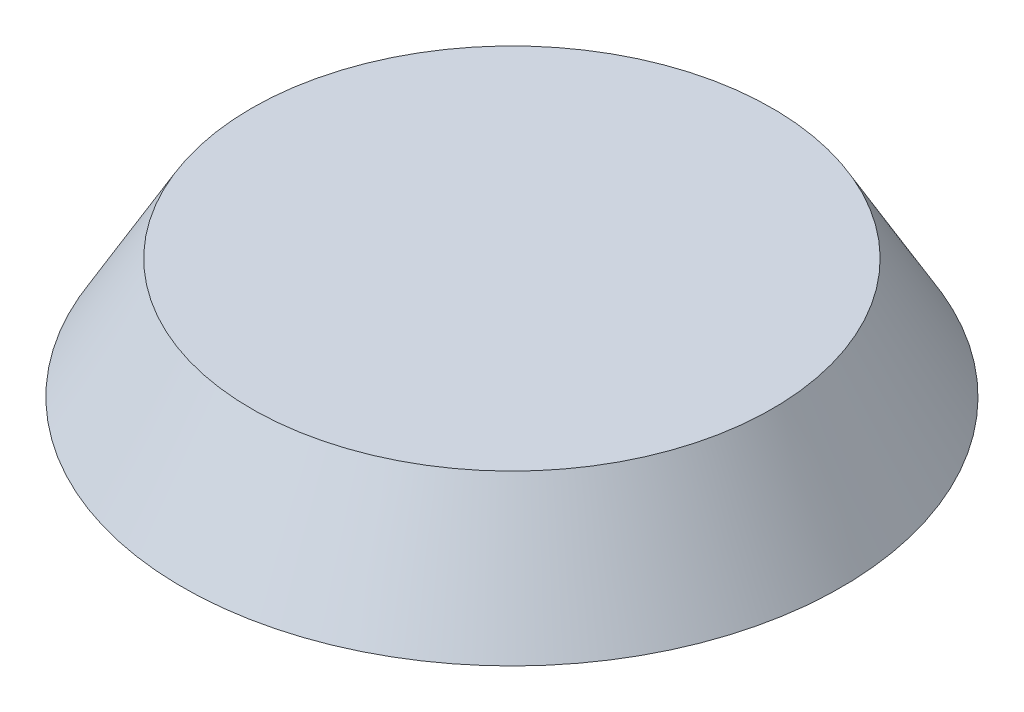
ISO-10303-21;
HEADER;
FILE_DESCRIPTION(('STEP AP214'),'2;1');
FILE_NAME('part.step','',(''),(''),'','','');
FILE_SCHEMA(('AUTOMOTIVE_DESIGN { 1 0 10303 214 1 1 1 1 }'));
ENDSEC;
DATA;
#1=APPLICATION_CONTEXT('core data for automotive mechanical design processes');
#2=APPLICATION_PROTOCOL_DEFINITION('international standard','automotive_design',2000,#1);
#3=PRODUCT_CONTEXT('',#1,'mechanical');
#4=PRODUCT('Part','Part','',(#3));
#5=PRODUCT_RELATED_PRODUCT_CATEGORY('part','',(#4));
#6=PRODUCT_DEFINITION_FORMATION('','',#4);
#7=PRODUCT_DEFINITION_CONTEXT('part definition',#1,'design');
#8=PRODUCT_DEFINITION('design','',#6,#7);
#9=PRODUCT_DEFINITION_SHAPE('','',#8);
#10=(LENGTH_UNIT() NAMED_UNIT(*) SI_UNIT(.MILLI.,.METRE.));
#11=(NAMED_UNIT(*) PLANE_ANGLE_UNIT() SI_UNIT($,.RADIAN.));
#12=(NAMED_UNIT(*) SI_UNIT($,.STERADIAN.) SOLID_ANGLE_UNIT());
#13=UNCERTAINTY_MEASURE_WITH_UNIT(LENGTH_MEASURE(1.E-05),#10,'distance_accuracy_value','');
#14=(GEOMETRIC_REPRESENTATION_CONTEXT(3) GLOBAL_UNCERTAINTY_ASSIGNED_CONTEXT((#13)) GLOBAL_UNIT_ASSIGNED_CONTEXT((#10,
#11,#12)) REPRESENTATION_CONTEXT('',''));
#15=CARTESIAN_POINT('',(0.,0.,0.));
#16=DIRECTION('',(0.,0.,1.));
#17=DIRECTION('',(1.,0.,0.));
#18=AXIS2_PLACEMENT_3D('',#15,#16,#17);
#19=CARTESIAN_POINT('',(0.,0.,-18.6));
#20=DIRECTION('',(0.,-1.,0.));
#21=DIRECTION('',(0.,0.,1.));
#22=AXIS2_PLACEMENT_3D('',#19,#20,#21);
#23=CONICAL_SURFACE('',#22,4.2,0.0174532925199433);
#24=CARTESIAN_POINT('',(0.,0.,-18.6));
#25=DIRECTION('',(0.,-1.,0.));
#26=DIRECTION('',(0.,0.,1.));
#27=AXIS2_PLACEMENT_3D('',#24,#25,#26);
#28=CIRCLE('',#27,4.2);
#29=CARTESIAN_POINT('',(4.2,0.,-18.6));
#30=VERTEX_POINT('',#29);
#31=CARTESIAN_POINT('',(-4.2,0.,-18.6));
#32=VERTEX_POINT('',#31);
#33=EDGE_CURVE('E176',#30,#32,#28,.T.);
#34=ORIENTED_EDGE('',*,*,#33,.F.);
#35=DIRECTION('',(-0.0174524064372835,0.999847695156391,0.));
#36=VECTOR('',#35,1.);
#37=CARTESIAN_POINT('',(4.2,0.,-18.6));
#38=LINE('',#37,#36);
#39=CARTESIAN_POINT('',(4.28727532464109,-5.,-18.6));
#40=VERTEX_POINT('',#39);
#41=EDGE_CURVE('E11',#40,#30,#38,.T.);
#42=ORIENTED_EDGE('',*,*,#41,.F.);
#43=CARTESIAN_POINT('',(0.,-5.,-18.6));
#44=DIRECTION('',(0.,1.,0.));
#45=DIRECTION('',(0.,0.,1.));
#46=AXIS2_PLACEMENT_3D('',#43,#44,#45);
#47=CIRCLE('',#46,4.28727532464109);
#48=CARTESIAN_POINT('',(-4.28727532464109,-5.,-18.6));
#49=VERTEX_POINT('',#48);
#50=EDGE_CURVE('E195',#40,#49,#47,.F.);
#51=ORIENTED_EDGE('',*,*,#50,.T.);
#52=DIRECTION('',(0.0174524064372835,0.999847695156391,0.));
#53=VECTOR('',#52,1.);
#54=CARTESIAN_POINT('',(-4.2,0.,-18.6));
#55=LINE('',#54,#53);
#56=EDGE_CURVE('E123',#49,#32,#55,.T.);
#57=ORIENTED_EDGE('',*,*,#56,.T.);
#58=EDGE_LOOP('',(#34,#42,#51,#57));
#59=FACE_BOUND('',#58,.T.);
#60=ADVANCED_FACE('F49',(#59),#23,.F.);
#61=CARTESIAN_POINT('',(4.2,0.,-18.6));
#62=DIRECTION('',(-0.999847695156391,-0.0174524064372835,0.));
#63=DIRECTION('',(0.0174524064372835,-0.999847695156391,0.));
#64=AXIS2_PLACEMENT_3D('',#61,#62,#63);
#65=PLANE('',#64);
#66=DIRECTION('',(0.,0.,1.));
#67=VECTOR('',#66,1.);
#68=CARTESIAN_POINT('',(4.2,0.,-18.6));
#69=LINE('',#68,#67);
#70=CARTESIAN_POINT('',(4.2,0.,-22.6132704401641));
#71=VERTEX_POINT('',#70);
#72=EDGE_CURVE('E187',#71,#30,#69,.T.);
#73=ORIENTED_EDGE('',*,*,#72,.F.);
#74=CARTESIAN_POINT('',(4.28727532464109,-5.,-22.508047946002));
#75=CARTESIAN_POINT('',(4.27272945221222,-4.1666675266641,-22.5256259065232));
#76=CARTESIAN_POINT('',(4.25818357227769,-3.333334623329,-22.5431834279639));
#77=CARTESIAN_POINT('',(4.22909179739732,-1.66666795666234,-22.5782575926847));
#78=CARTESIAN_POINT('',(4.2145459024515,-0.833334193330764,-22.5957742359646));
#79=CARTESIAN_POINT('',(4.2,0.,-22.6132704401641));
#80=B_SPLINE_CURVE_WITH_KNOTS('',3,(#74,#75,#76,#77,#78,#79),.UNSPECIFIED.,.F.,.F.,(4,2,4),(0.,
2.50093426396377,5.00186852792182),.UNSPECIFIED.);
#81=CARTESIAN_POINT('',(4.28727532464109,-5.,-22.508047946002));
#82=VERTEX_POINT('',#81);
#83=EDGE_CURVE('E60',#82,#71,#80,.T.);
#84=ORIENTED_EDGE('',*,*,#83,.F.);
#85=DIRECTION('',(0.,0.,1.));
#86=VECTOR('',#85,1.);
#87=CARTESIAN_POINT('',(4.28727532464109,-5.,-18.6));
#88=LINE('',#87,#86);
#89=EDGE_CURVE('E190',#82,#40,#88,.T.);
#90=ORIENTED_EDGE('',*,*,#89,.T.);
#91=ORIENTED_EDGE('',*,*,#41,.T.);
#92=EDGE_LOOP('',(#73,#84,#90,#91));
#93=FACE_BOUND('',#92,.T.);
#94=ADVANCED_FACE('F186',(#93),#65,.T.);
#95=CARTESIAN_POINT('',(0.,0.,0.));
#96=DIRECTION('',(0.,1.,0.));
#97=DIRECTION('',(0.,0.,1.));
#98=AXIS2_PLACEMENT_3D('',#95,#96,#97);
#99=CONICAL_SURFACE('',#98,23.,0.0174532925199433);
#100=CARTESIAN_POINT('',(0.,0.,0.));
#101=DIRECTION('',(0.,1.,0.));
#102=DIRECTION('',(0.,0.,1.));
#103=AXIS2_PLACEMENT_3D('',#100,#101,#102);
#104=CIRCLE('',#103,23.);
#105=CARTESIAN_POINT('',(22.6132704401641,0.,-4.19999999999994));
#106=VERTEX_POINT('',#105);
#107=EDGE_CURVE('E193',#106,#71,#104,.T.);
#108=ORIENTED_EDGE('',*,*,#107,.F.);
#109=CARTESIAN_POINT('',(22.508047946002,-5.,-4.28727532464102));
#110=CARTESIAN_POINT('',(22.5256259065232,-4.1666675266641,-4.27272945221215));
#111=CARTESIAN_POINT('',(22.543183427964,-3.333334623329,-4.25818357227762));
#112=CARTESIAN_POINT('',(22.5782575926847,-1.66666795666234,-4.22909179739726));
#113=CARTESIAN_POINT('',(22.5957742359646,-0.833334193330765,-4.21454590245143));
#114=CARTESIAN_POINT('',(22.6132704401641,0.,-4.19999999999994));
#115=B_SPLINE_CURVE_WITH_KNOTS('',3,(#109,#110,#111,#112,#113,#114),.UNSPECIFIED.,.F.,.F.,(4,2,
4),(0.,2.50093426396377,5.00186852792182),.UNSPECIFIED.);
#116=CARTESIAN_POINT('',(22.508047946002,-5.,-4.28727532464102));
#117=VERTEX_POINT('',#116);
#118=EDGE_CURVE('E136',#117,#106,#115,.T.);
#119=ORIENTED_EDGE('',*,*,#118,.F.);
#120=CARTESIAN_POINT('',(0.,-5.,0.));
#121=DIRECTION('',(0.,1.,0.));
#122=DIRECTION('',(0.,0.,1.));
#123=AXIS2_PLACEMENT_3D('',#120,#121,#122);
#124=CIRCLE('',#123,22.9127246753589);
#125=EDGE_CURVE('E386',#117,#82,#124,.T.);
#126=ORIENTED_EDGE('',*,*,#125,.T.);
#127=ORIENTED_EDGE('',*,*,#83,.T.);
#128=EDGE_LOOP('',(#108,#119,#126,#127));
#129=FACE_BOUND('',#128,.T.);
#130=ADVANCED_FACE('F305',(#129),#99,.T.);
#131=CARTESIAN_POINT('',(18.6,0.,-4.19999999999994));
#132=DIRECTION('',(0.,-0.0174524064372835,0.999847695156391));
#133=DIRECTION('',(0.,-0.999847695156391,-0.0174524064372835));
#134=AXIS2_PLACEMENT_3D('',#131,#132,#133);
#135=PLANE('',#134);
#136=DIRECTION('',(1.,0.,0.));
#137=VECTOR('',#136,1.);
#138=CARTESIAN_POINT('',(18.6,0.,-4.19999999999994));
#139=LINE('',#138,#137);
#140=CARTESIAN_POINT('',(18.6,0.,-4.19999999999994));
#141=VERTEX_POINT('',#140);
#142=EDGE_CURVE('E203',#141,#106,#139,.T.);
#143=ORIENTED_EDGE('',*,*,#142,.F.);
#144=DIRECTION('',(0.,0.999847695156391,0.0174524064372835));
#145=VECTOR('',#144,1.);
#146=CARTESIAN_POINT('',(18.6,0.,-4.19999999999993));
#147=LINE('',#146,#145);
#148=CARTESIAN_POINT('',(18.6,-5.,-4.28727532464102));
#149=VERTEX_POINT('',#148);
#150=EDGE_CURVE('E315',#149,#141,#147,.T.);
#151=ORIENTED_EDGE('',*,*,#150,.F.);
#152=DIRECTION('',(1.,0.,0.));
#153=VECTOR('',#152,1.);
#154=CARTESIAN_POINT('',(0.,-5.,-4.28727532464102));
#155=LINE('',#154,#153);
#156=EDGE_CURVE('E375',#149,#117,#155,.T.);
#157=ORIENTED_EDGE('',*,*,#156,.T.);
#158=ORIENTED_EDGE('',*,*,#118,.T.);
#159=EDGE_LOOP('',(#143,#151,#157,#158));
#160=FACE_BOUND('',#159,.T.);
#161=ADVANCED_FACE('F301',(#160),#135,.T.);
#162=CARTESIAN_POINT('',(18.6,0.,0.));
#163=DIRECTION('',(0.,-1.,0.));
#164=DIRECTION('',(0.,0.,-1.));
#165=AXIS2_PLACEMENT_3D('',#162,#163,#164);
#166=CONICAL_SURFACE('',#165,4.2,0.0174532925199433);
#167=CARTESIAN_POINT('',(18.6,0.,0.));
#168=DIRECTION('',(0.,-1.,0.));
#169=DIRECTION('',(0.,0.,-1.));
#170=AXIS2_PLACEMENT_3D('',#167,#168,#169);
#171=CIRCLE('',#170,4.2);
#172=CARTESIAN_POINT('',(18.6,0.,4.20000000000006));
#173=VERTEX_POINT('',#172);
#174=EDGE_CURVE('E367',#173,#141,#171,.T.);
#175=ORIENTED_EDGE('',*,*,#174,.F.);
#176=DIRECTION('',(0.,0.999847695156391,-0.0174524064372835));
#177=VECTOR('',#176,1.);
#178=CARTESIAN_POINT('',(18.6,0.,4.20000000000006));
#179=LINE('',#178,#177);
#180=CARTESIAN_POINT('',(18.6,-5.,4.28727532464115));
#181=VERTEX_POINT('',#180);
#182=EDGE_CURVE('E294',#181,#173,#179,.T.);
#183=ORIENTED_EDGE('',*,*,#182,.F.);
#184=CARTESIAN_POINT('',(18.6,-5.,0.));
#185=DIRECTION('',(0.,1.,0.));
#186=DIRECTION('',(0.,0.,1.));
#187=AXIS2_PLACEMENT_3D('',#184,#185,#186);
#188=CIRCLE('',#187,4.28727532464109);
#189=EDGE_CURVE('E384',#181,#149,#188,.F.);
#190=ORIENTED_EDGE('',*,*,#189,.T.);
#191=ORIENTED_EDGE('',*,*,#150,.T.);
#192=EDGE_LOOP('',(#175,#183,#190,#191));
#193=FACE_BOUND('',#192,.T.);
#194=ADVANCED_FACE('F51',(#193),#166,.F.);
#195=CARTESIAN_POINT('',(18.6,0.,4.20000000000006));
#196=DIRECTION('',(0.,-0.0174524064372835,-0.999847695156391));
#197=DIRECTION('',(0.,0.999847695156391,-0.0174524064372835));
#198=AXIS2_PLACEMENT_3D('',#195,#196,#197);
#199=PLANE('',#198);
#200=DIRECTION('',(-1.,0.,0.));
#201=VECTOR('',#200,1.);
#202=CARTESIAN_POINT('',(18.6,0.,4.20000000000006));
#203=LINE('',#202,#201);
#204=CARTESIAN_POINT('',(22.6132704401641,0.,4.20000000000006));
#205=VERTEX_POINT('',#204);
#206=EDGE_CURVE('E363',#205,#173,#203,.T.);
#207=ORIENTED_EDGE('',*,*,#206,.F.);
#208=CARTESIAN_POINT('',(22.508047946002,-5.,4.28727532464115));
#209=CARTESIAN_POINT('',(22.5256259065232,-4.1666675266641,4.27272945221228));
#210=CARTESIAN_POINT('',(22.5431834279639,-3.333334623329,4.25818357227775));
#211=CARTESIAN_POINT('',(22.5782575926846,-1.66666795666234,4.22909179739738));
#212=CARTESIAN_POINT('',(22.5957742359646,-0.833334193330764,4.21454590245156));
#213=CARTESIAN_POINT('',(22.6132704401641,0.,4.20000000000006));
#214=B_SPLINE_CURVE_WITH_KNOTS('',3,(#208,#209,#210,#211,#212,#213),.UNSPECIFIED.,.F.,.F.,(4,2,
4),(0.,2.50093426396377,5.00186852792182),.UNSPECIFIED.);
#215=CARTESIAN_POINT('',(22.508047946002,-5.,4.28727532464115));
#216=VERTEX_POINT('',#215);
#217=EDGE_CURVE('E286',#216,#205,#214,.T.);
#218=ORIENTED_EDGE('',*,*,#217,.F.);
#219=DIRECTION('',(-1.,0.,0.));
#220=VECTOR('',#219,1.);
#221=CARTESIAN_POINT('',(0.,-5.,4.28727532464115));
#222=LINE('',#221,#220);
#223=EDGE_CURVE('E390',#216,#181,#222,.T.);
#224=ORIENTED_EDGE('',*,*,#223,.T.);
#225=ORIENTED_EDGE('',*,*,#182,.T.);
#226=EDGE_LOOP('',(#207,#218,#224,#225));
#227=FACE_BOUND('',#226,.T.);
#228=ADVANCED_FACE('F296',(#227),#199,.T.);
#229=CARTESIAN_POINT('',(0.,0.,0.));
#230=DIRECTION('',(0.,1.,0.));
#231=DIRECTION('',(0.,0.,1.));
#232=AXIS2_PLACEMENT_3D('',#229,#230,#231);
#233=CONICAL_SURFACE('',#232,23.,0.0174532925199433);
#234=CARTESIAN_POINT('',(0.,0.,0.));
#235=DIRECTION('',(0.,1.,0.));
#236=DIRECTION('',(0.,0.,1.));
#237=AXIS2_PLACEMENT_3D('',#234,#235,#236);
#238=CIRCLE('',#237,23.);
#239=CARTESIAN_POINT('',(4.2,0.,22.6132704401641));
#240=VERTEX_POINT('',#239);
#241=EDGE_CURVE('E360',#240,#205,#238,.T.);
#242=ORIENTED_EDGE('',*,*,#241,.F.);
#243=CARTESIAN_POINT('',(4.28727532464109,-5.,22.508047946002));
#244=CARTESIAN_POINT('',(4.27272945221222,-4.1666675266641,22.5256259065232));
#245=CARTESIAN_POINT('',(4.25818357227769,-3.333334623329,22.5431834279639));
#246=CARTESIAN_POINT('',(4.22909179739732,-1.66666795666234,22.5782575926847));
#247=CARTESIAN_POINT('',(4.2145459024515,-0.833334193330764,22.5957742359646));
#248=CARTESIAN_POINT('',(4.2,0.,22.6132704401641));
#249=B_SPLINE_CURVE_WITH_KNOTS('',3,(#243,#244,#245,#246,#247,#248),.UNSPECIFIED.,.F.,.F.,(4,2,
4),(0.,2.50093426396377,5.00186852792182),.UNSPECIFIED.);
#250=CARTESIAN_POINT('',(4.28727532464109,-5.,22.508047946002));
#251=VERTEX_POINT('',#250);
#252=EDGE_CURVE('E279',#251,#240,#249,.T.);
#253=ORIENTED_EDGE('',*,*,#252,.F.);
#254=CARTESIAN_POINT('',(0.,-5.,0.));
#255=DIRECTION('',(0.,1.,0.));
#256=DIRECTION('',(0.,0.,1.));
#257=AXIS2_PLACEMENT_3D('',#254,#255,#256);
#258=CIRCLE('',#257,22.9127246753589);
#259=EDGE_CURVE('E395',#251,#216,#258,.T.);
#260=ORIENTED_EDGE('',*,*,#259,.T.);
#261=ORIENTED_EDGE('',*,*,#217,.T.);
#262=EDGE_LOOP('',(#242,#253,#260,#261));
#263=FACE_BOUND('',#262,.T.);
#264=ADVANCED_FACE('F274',(#263),#233,.T.);
#265=CARTESIAN_POINT('',(4.2,0.,18.6));
#266=DIRECTION('',(-0.999847695156391,-0.0174524064372835,0.));
#267=DIRECTION('',(0.0174524064372835,-0.999847695156391,0.));
#268=AXIS2_PLACEMENT_3D('',#265,#266,#267);
#269=PLANE('',#268);
#270=DIRECTION('',(0.,0.,1.));
#271=VECTOR('',#270,1.);
#272=CARTESIAN_POINT('',(4.2,0.,18.6));
#273=LINE('',#272,#271);
#274=CARTESIAN_POINT('',(4.2,0.,18.6));
#275=VERTEX_POINT('',#274);
#276=EDGE_CURVE('E341',#275,#240,#273,.T.);
#277=ORIENTED_EDGE('',*,*,#276,.F.);
#278=DIRECTION('',(-0.0174524064372835,0.999847695156391,0.));
#279=VECTOR('',#278,1.);
#280=CARTESIAN_POINT('',(4.2,0.,18.6));
#281=LINE('',#280,#279);
#282=CARTESIAN_POINT('',(4.28727532464109,-5.,18.6));
#283=VERTEX_POINT('',#282);
#284=EDGE_CURVE('E287',#283,#275,#281,.T.);
#285=ORIENTED_EDGE('',*,*,#284,.F.);
#286=DIRECTION('',(0.,0.,1.));
#287=VECTOR('',#286,1.);
#288=CARTESIAN_POINT('',(4.28727532464109,-5.,-18.6));
#289=LINE('',#288,#287);
#290=EDGE_CURVE('E402',#283,#251,#289,.T.);
#291=ORIENTED_EDGE('',*,*,#290,.T.);
#292=ORIENTED_EDGE('',*,*,#252,.T.);
#293=EDGE_LOOP('',(#277,#285,#291,#292));
#294=FACE_BOUND('',#293,.T.);
#295=ADVANCED_FACE('F270',(#294),#269,.T.);
#296=CARTESIAN_POINT('',(0.,0.,18.6));
#297=DIRECTION('',(0.,-1.,0.));
#298=DIRECTION('',(0.,0.,-1.));
#299=AXIS2_PLACEMENT_3D('',#296,#297,#298);
#300=CONICAL_SURFACE('',#299,4.2,0.0174532925199433);
#301=CARTESIAN_POINT('',(0.,0.,18.6));
#302=DIRECTION('',(0.,-1.,0.));
#303=DIRECTION('',(0.,0.,-1.));
#304=AXIS2_PLACEMENT_3D('',#301,#302,#303);
#305=CIRCLE('',#304,4.2);
#306=CARTESIAN_POINT('',(-4.2,0.,18.6));
#307=VERTEX_POINT('',#306);
#308=EDGE_CURVE('E334',#307,#275,#305,.T.);
#309=ORIENTED_EDGE('',*,*,#308,.F.);
#310=DIRECTION('',(0.0174524064372835,0.999847695156391,0.));
#311=VECTOR('',#310,1.);
#312=CARTESIAN_POINT('',(-4.2,0.,18.6));
#313=LINE('',#312,#311);
#314=CARTESIAN_POINT('',(-4.28727532464108,-5.,18.6));
#315=VERTEX_POINT('',#314);
#316=EDGE_CURVE('E262',#315,#307,#313,.T.);
#317=ORIENTED_EDGE('',*,*,#316,.F.);
#318=CARTESIAN_POINT('',(0.,-5.,18.6));
#319=DIRECTION('',(0.,1.,0.));
#320=DIRECTION('',(0.,0.,1.));
#321=AXIS2_PLACEMENT_3D('',#318,#319,#320);
#322=CIRCLE('',#321,4.28727532464109);
#323=EDGE_CURVE('E406',#315,#283,#322,.F.);
#324=ORIENTED_EDGE('',*,*,#323,.T.);
#325=ORIENTED_EDGE('',*,*,#284,.T.);
#326=EDGE_LOOP('',(#309,#317,#324,#325));
#327=FACE_BOUND('',#326,.T.);
#328=ADVANCED_FACE('F268',(#327),#300,.F.);
#329=CARTESIAN_POINT('',(-4.2,0.,18.6));
#330=DIRECTION('',(0.999847695156391,-0.0174524064372835,0.));
#331=DIRECTION('',(0.0174524064372835,0.999847695156391,0.));
#332=AXIS2_PLACEMENT_3D('',#329,#330,#331);
#333=PLANE('',#332);
#334=DIRECTION('',(0.,0.,-1.));
#335=VECTOR('',#334,1.);
#336=CARTESIAN_POINT('',(-4.2,0.,18.6));
#337=LINE('',#336,#335);
#338=CARTESIAN_POINT('',(-4.2,0.,22.6132704401641));
#339=VERTEX_POINT('',#338);
#340=EDGE_CURVE('E342',#339,#307,#337,.T.);
#341=ORIENTED_EDGE('',*,*,#340,.F.);
#342=CARTESIAN_POINT('',(-4.28727532464108,-5.,22.508047946002));
#343=CARTESIAN_POINT('',(-4.27272945221222,-4.1666675266641,22.5256259065232));
#344=CARTESIAN_POINT('',(-4.25818357227768,-3.333334623329,22.5431834279639));
#345=CARTESIAN_POINT('',(-4.22909179739732,-1.66666795666234,22.5782575926847));
#346=CARTESIAN_POINT('',(-4.21454590245149,-0.833334193330764,22.5957742359646));
#347=CARTESIAN_POINT('',(-4.2,0.,22.6132704401641));
#348=B_SPLINE_CURVE_WITH_KNOTS('',3,(#342,#343,#344,#345,#346,#347),.UNSPECIFIED.,.F.,.F.,(4,2,
4),(0.,2.50093426396377,5.00186852792182),.UNSPECIFIED.);
#349=CARTESIAN_POINT('',(-4.28727532464108,-5.,22.508047946002));
#350=VERTEX_POINT('',#349);
#351=EDGE_CURVE('E254',#350,#339,#348,.T.);
#352=ORIENTED_EDGE('',*,*,#351,.F.);
#353=DIRECTION('',(0.,0.,-1.));
#354=VECTOR('',#353,1.);
#355=CARTESIAN_POINT('',(-4.28727532464108,-5.,-18.6));
#356=LINE('',#355,#354);
#357=EDGE_CURVE('E409',#350,#315,#356,.T.);
#358=ORIENTED_EDGE('',*,*,#357,.T.);
#359=ORIENTED_EDGE('',*,*,#316,.T.);
#360=EDGE_LOOP('',(#341,#352,#358,#359));
#361=FACE_BOUND('',#360,.T.);
#362=ADVANCED_FACE('F264',(#361),#333,.T.);
#363=CARTESIAN_POINT('',(0.,0.,0.));
#364=DIRECTION('',(0.,1.,0.));
#365=DIRECTION('',(0.,0.,1.));
#366=AXIS2_PLACEMENT_3D('',#363,#364,#365);
#367=CONICAL_SURFACE('',#366,23.,0.0174532925199433);
#368=CARTESIAN_POINT('',(0.,0.,0.));
#369=DIRECTION('',(0.,1.,0.));
#370=DIRECTION('',(0.,0.,1.));
#371=AXIS2_PLACEMENT_3D('',#368,#369,#370);
#372=CIRCLE('',#371,23.);
#373=CARTESIAN_POINT('',(-22.6132704401641,0.,4.20000000000005));
#374=VERTEX_POINT('',#373);
#375=EDGE_CURVE('E348',#374,#339,#372,.T.);
#376=ORIENTED_EDGE('',*,*,#375,.F.);
#377=CARTESIAN_POINT('',(-22.508047946002,-5.,4.28727532464115));
#378=CARTESIAN_POINT('',(-22.5256259065232,-4.1666675266641,4.27272945221228));
#379=CARTESIAN_POINT('',(-22.5431834279639,-3.333334623329,4.25818357227775));
#380=CARTESIAN_POINT('',(-22.5782575926846,-1.66666795666234,4.22909179739738));
#381=CARTESIAN_POINT('',(-22.5957742359646,-0.833334193330764,4.21454590245156));
#382=CARTESIAN_POINT('',(-22.6132704401641,0.,4.20000000000006));
#383=B_SPLINE_CURVE_WITH_KNOTS('',3,(#377,#378,#379,#380,#381,#382),.UNSPECIFIED.,.F.,.F.,(4,2,
4),(0.,2.50093426396377,5.00186852792182),.UNSPECIFIED.);
#384=CARTESIAN_POINT('',(-22.508047946002,-5.,4.28727532464115));
#385=VERTEX_POINT('',#384);
#386=EDGE_CURVE('E246',#385,#374,#383,.T.);
#387=ORIENTED_EDGE('',*,*,#386,.F.);
#388=CARTESIAN_POINT('',(0.,-5.,0.));
#389=DIRECTION('',(0.,1.,0.));
#390=DIRECTION('',(0.,0.,1.));
#391=AXIS2_PLACEMENT_3D('',#388,#389,#390);
#392=CIRCLE('',#391,22.9127246753589);
#393=EDGE_CURVE('E413',#385,#350,#392,.T.);
#394=ORIENTED_EDGE('',*,*,#393,.T.);
#395=ORIENTED_EDGE('',*,*,#351,.T.);
#396=EDGE_LOOP('',(#376,#387,#394,#395));
#397=FACE_BOUND('',#396,.T.);
#398=ADVANCED_FACE('F241',(#397),#367,.T.);
#399=CARTESIAN_POINT('',(-18.6,0.,4.20000000000006));
#400=DIRECTION('',(0.,-0.0174524064372835,-0.999847695156391));
#401=DIRECTION('',(0.,0.999847695156391,-0.0174524064372835));
#402=AXIS2_PLACEMENT_3D('',#399,#400,#401);
#403=PLANE('',#402);
#404=DIRECTION('',(-1.,0.,0.));
#405=VECTOR('',#404,1.);
#406=CARTESIAN_POINT('',(-18.6,0.,4.20000000000006));
#407=LINE('',#406,#405);
#408=CARTESIAN_POINT('',(-18.6,0.,4.20000000000006));
#409=VERTEX_POINT('',#408);
#410=EDGE_CURVE('E354',#409,#374,#407,.T.);
#411=ORIENTED_EDGE('',*,*,#410,.F.);
#412=DIRECTION('',(0.,0.999847695156391,-0.0174524064372835));
#413=VECTOR('',#412,1.);
#414=CARTESIAN_POINT('',(-18.6,0.,4.20000000000006));
#415=LINE('',#414,#413);
#416=CARTESIAN_POINT('',(-18.6,-5.,4.28727532464115));
#417=VERTEX_POINT('',#416);
#418=EDGE_CURVE('E255',#417,#409,#415,.T.);
#419=ORIENTED_EDGE('',*,*,#418,.F.);
#420=DIRECTION('',(-1.,0.,0.));
#421=VECTOR('',#420,1.);
#422=CARTESIAN_POINT('',(0.,-5.,4.28727532464115));
#423=LINE('',#422,#421);
#424=EDGE_CURVE('E416',#417,#385,#423,.T.);
#425=ORIENTED_EDGE('',*,*,#424,.T.);
#426=ORIENTED_EDGE('',*,*,#386,.T.);
#427=EDGE_LOOP('',(#411,#419,#425,#426));
#428=FACE_BOUND('',#427,.T.);
#429=ADVANCED_FACE('F237',(#428),#403,.T.);
#430=CARTESIAN_POINT('',(-18.6,0.,0.));
#431=DIRECTION('',(0.,-1.,0.));
#432=DIRECTION('',(0.,0.,1.));
#433=AXIS2_PLACEMENT_3D('',#430,#431,#432);
#434=CONICAL_SURFACE('',#433,4.2,0.0174532925199433);
#435=CARTESIAN_POINT('',(-18.6,0.,0.));
#436=DIRECTION('',(0.,-1.,0.));
#437=DIRECTION('',(0.,0.,1.));
#438=AXIS2_PLACEMENT_3D('',#435,#436,#437);
#439=CIRCLE('',#438,4.2);
#440=CARTESIAN_POINT('',(-18.6,0.,-4.19999999999994));
#441=VERTEX_POINT('',#440);
#442=EDGE_CURVE('E452',#441,#409,#439,.T.);
#443=ORIENTED_EDGE('',*,*,#442,.F.);
#444=DIRECTION('',(0.,0.999847695156391,0.0174524064372835));
#445=VECTOR('',#444,1.);
#446=CARTESIAN_POINT('',(-18.6,0.,-4.19999999999994));
#447=LINE('',#446,#445);
#448=CARTESIAN_POINT('',(-18.6,-5.,-4.28727532464102));
#449=VERTEX_POINT('',#448);
#450=EDGE_CURVE('E436',#449,#441,#447,.T.);
#451=ORIENTED_EDGE('',*,*,#450,.F.);
#452=CARTESIAN_POINT('',(-18.6,-5.,0.));
#453=DIRECTION('',(0.,1.,0.));
#454=DIRECTION('',(0.,0.,1.));
#455=AXIS2_PLACEMENT_3D('',#452,#453,#454);
#456=CIRCLE('',#455,4.28727532464109);
#457=EDGE_CURVE('E419',#449,#417,#456,.F.);
#458=ORIENTED_EDGE('',*,*,#457,.T.);
#459=ORIENTED_EDGE('',*,*,#418,.T.);
#460=EDGE_LOOP('',(#443,#451,#458,#459));
#461=FACE_BOUND('',#460,.T.);
#462=ADVANCED_FACE('F235',(#461),#434,.F.);
#463=CARTESIAN_POINT('',(-18.6,0.,-4.19999999999994));
#464=DIRECTION('',(0.,-0.0174524064372835,0.999847695156391));
#465=DIRECTION('',(0.,-0.999847695156391,-0.0174524064372835));
#466=AXIS2_PLACEMENT_3D('',#463,#464,#465);
#467=PLANE('',#466);
#468=DIRECTION('',(1.,0.,0.));
#469=VECTOR('',#468,1.);
#470=CARTESIAN_POINT('',(-18.6,0.,-4.19999999999994));
#471=LINE('',#470,#469);
#472=CARTESIAN_POINT('',(-22.6132704401641,0.,-4.19999999999994));
#473=VERTEX_POINT('',#472);
#474=EDGE_CURVE('E439',#473,#441,#471,.T.);
#475=ORIENTED_EDGE('',*,*,#474,.F.);
#476=CARTESIAN_POINT('',(-22.508047946002,-5.,-4.28727532464102));
#477=CARTESIAN_POINT('',(-22.5256259065232,-4.1666675266641,-4.27272945221215));
#478=CARTESIAN_POINT('',(-22.543183427964,-3.333334623329,-4.25818357227762));
#479=CARTESIAN_POINT('',(-22.5782575926847,-1.66666795666234,-4.22909179739726));
#480=CARTESIAN_POINT('',(-22.5957742359646,-0.833334193330765,-4.21454590245143));
#481=CARTESIAN_POINT('',(-22.6132704401641,0.,-4.19999999999994));
#482=B_SPLINE_CURVE_WITH_KNOTS('',3,(#476,#477,#478,#479,#480,#481),.UNSPECIFIED.,.F.,.F.,(4,2,
4),(0.,2.50093426396377,5.00186852792182),.UNSPECIFIED.);
#483=CARTESIAN_POINT('',(-22.508047946002,-5.,-4.28727532464102));
#484=VERTEX_POINT('',#483);
#485=EDGE_CURVE('E217',#484,#473,#482,.T.);
#486=ORIENTED_EDGE('',*,*,#485,.F.);
#487=DIRECTION('',(1.,0.,0.));
#488=VECTOR('',#487,1.);
#489=CARTESIAN_POINT('',(0.,-5.,-4.28727532464102));
#490=LINE('',#489,#488);
#491=EDGE_CURVE('E423',#484,#449,#490,.T.);
#492=ORIENTED_EDGE('',*,*,#491,.T.);
#493=ORIENTED_EDGE('',*,*,#450,.T.);
#494=EDGE_LOOP('',(#475,#486,#492,#493));
#495=FACE_BOUND('',#494,.T.);
#496=ADVANCED_FACE('F230',(#495),#467,.T.);
#497=CARTESIAN_POINT('',(0.,0.,0.));
#498=DIRECTION('',(0.,1.,0.));
#499=DIRECTION('',(0.,0.,1.));
#500=AXIS2_PLACEMENT_3D('',#497,#498,#499);
#501=CONICAL_SURFACE('',#500,23.,0.0174532925199433);
#502=CARTESIAN_POINT('',(0.,0.,0.));
#503=DIRECTION('',(0.,1.,0.));
#504=DIRECTION('',(0.,0.,1.));
#505=AXIS2_PLACEMENT_3D('',#502,#503,#504);
#506=CIRCLE('',#505,23.);
#507=CARTESIAN_POINT('',(-4.2,0.,-22.6132704401641));
#508=VERTEX_POINT('',#507);
#509=EDGE_CURVE('E457',#508,#473,#506,.T.);
#510=ORIENTED_EDGE('',*,*,#509,.F.);
#511=CARTESIAN_POINT('',(-4.28727532464109,-5.,-22.508047946002));
#512=CARTESIAN_POINT('',(-4.27272945221222,-4.1666675266641,-22.5256259065232));
#513=CARTESIAN_POINT('',(-4.25818357227769,-3.333334623329,-22.5431834279639));
#514=CARTESIAN_POINT('',(-4.22909179739732,-1.66666795666234,-22.5782575926847));
#515=CARTESIAN_POINT('',(-4.2145459024515,-0.833334193330764,-22.5957742359646));
#516=CARTESIAN_POINT('',(-4.2,0.,-22.6132704401641));
#517=B_SPLINE_CURVE_WITH_KNOTS('',3,(#511,#512,#513,#514,#515,#516),.UNSPECIFIED.,.F.,.F.,(4,2,
4),(0.,2.50093426396377,5.00186852792182),.UNSPECIFIED.);
#518=CARTESIAN_POINT('',(-4.28727532464109,-5.,-22.508047946002));
#519=VERTEX_POINT('',#518);
#520=EDGE_CURVE('E116',#519,#508,#517,.T.);
#521=ORIENTED_EDGE('',*,*,#520,.F.);
#522=CARTESIAN_POINT('',(0.,-5.,0.));
#523=DIRECTION('',(0.,1.,0.));
#524=DIRECTION('',(0.,0.,1.));
#525=AXIS2_PLACEMENT_3D('',#522,#523,#524);
#526=CIRCLE('',#525,22.9127246753589);
#527=EDGE_CURVE('E426',#519,#484,#526,.T.);
#528=ORIENTED_EDGE('',*,*,#527,.T.);
#529=ORIENTED_EDGE('',*,*,#485,.T.);
#530=EDGE_LOOP('',(#510,#521,#528,#529));
#531=FACE_BOUND('',#530,.T.);
#532=ADVANCED_FACE('F227',(#531),#501,.T.);
#533=CARTESIAN_POINT('',(-4.2,0.,-18.6));
#534=DIRECTION('',(0.999847695156391,-0.0174524064372835,0.));
#535=DIRECTION('',(0.0174524064372835,0.999847695156391,0.));
#536=AXIS2_PLACEMENT_3D('',#533,#534,#535);
#537=PLANE('',#536);
#538=DIRECTION('',(0.,0.,-1.));
#539=VECTOR('',#538,1.);
#540=CARTESIAN_POINT('',(-4.2,0.,-18.6));
#541=LINE('',#540,#539);
#542=EDGE_CURVE('E181',#32,#508,#541,.T.);
#543=ORIENTED_EDGE('',*,*,#542,.F.);
#544=ORIENTED_EDGE('',*,*,#56,.F.);
#545=DIRECTION('',(0.,0.,-1.));
#546=VECTOR('',#545,1.);
#547=CARTESIAN_POINT('',(-4.28727532464109,-5.,-18.6));
#548=LINE('',#547,#546);
#549=EDGE_CURVE('E53',#49,#519,#548,.T.);
#550=ORIENTED_EDGE('',*,*,#549,.T.);
#551=ORIENTED_EDGE('',*,*,#520,.T.);
#552=EDGE_LOOP('',(#543,#544,#550,#551));
#553=FACE_BOUND('',#552,.T.);
#554=ADVANCED_FACE('F224',(#553),#537,.T.);
#555=CARTESIAN_POINT('',(0.,-5.,-18.6));
#556=DIRECTION('',(0.,1.,0.));
#557=DIRECTION('',(0.,0.,1.));
#558=AXIS2_PLACEMENT_3D('',#555,#556,#557);
#559=PLANE('',#558);
#560=ORIENTED_EDGE('',*,*,#50,.F.);
#561=ORIENTED_EDGE('',*,*,#89,.F.);
#562=ORIENTED_EDGE('',*,*,#125,.F.);
#563=ORIENTED_EDGE('',*,*,#156,.F.);
#564=ORIENTED_EDGE('',*,*,#189,.F.);
#565=ORIENTED_EDGE('',*,*,#223,.F.);
#566=ORIENTED_EDGE('',*,*,#259,.F.);
#567=ORIENTED_EDGE('',*,*,#290,.F.);
#568=ORIENTED_EDGE('',*,*,#323,.F.);
#569=ORIENTED_EDGE('',*,*,#357,.F.);
#570=ORIENTED_EDGE('',*,*,#393,.F.);
#571=ORIENTED_EDGE('',*,*,#424,.F.);
#572=ORIENTED_EDGE('',*,*,#457,.F.);
#573=ORIENTED_EDGE('',*,*,#491,.F.);
#574=ORIENTED_EDGE('',*,*,#527,.F.);
#575=ORIENTED_EDGE('',*,*,#549,.F.);
#576=EDGE_LOOP('',(#560,#561,#562,#563,#564,#565,#566,#567,#568,#569,#570,#571,#572,#573,#574,#575));
#577=FACE_BOUND('',#576,.T.);
#578=ADVANCED_FACE('F382',(#577),#559,.F.);
#579=CARTESIAN_POINT('',(0.,0.,0.));
#580=DIRECTION('',(0.,1.,0.));
#581=DIRECTION('',(-1.,0.,0.));
#582=AXIS2_PLACEMENT_3D('',#579,#580,#581);
#583=PLANE('',#582);
#584=CARTESIAN_POINT('',(0.,0.,0.));
#585=DIRECTION('',(0.,1.,0.));
#586=DIRECTION('',(-1.,0.,0.));
#587=AXIS2_PLACEMENT_3D('',#584,#585,#586);
#588=CIRCLE('',#587,55.);
#589=CARTESIAN_POINT('',(-55.,0.,0.));
#590=VERTEX_POINT('',#589);
#591=EDGE_CURVE('E182',#590,#590,#588,.T.);
#592=ORIENTED_EDGE('',*,*,#591,.F.);
#593=EDGE_LOOP('',(#592));
#594=FACE_BOUND('',#593,.T.);
#595=ORIENTED_EDGE('',*,*,#72,.T.);
#596=ORIENTED_EDGE('',*,*,#33,.T.);
#597=ORIENTED_EDGE('',*,*,#542,.T.);
#598=ORIENTED_EDGE('',*,*,#509,.T.);
#599=ORIENTED_EDGE('',*,*,#474,.T.);
#600=ORIENTED_EDGE('',*,*,#442,.T.);
#601=ORIENTED_EDGE('',*,*,#410,.T.);
#602=ORIENTED_EDGE('',*,*,#375,.T.);
#603=ORIENTED_EDGE('',*,*,#340,.T.);
#604=ORIENTED_EDGE('',*,*,#308,.T.);
#605=ORIENTED_EDGE('',*,*,#276,.T.);
#606=ORIENTED_EDGE('',*,*,#241,.T.);
#607=ORIENTED_EDGE('',*,*,#206,.T.);
#608=ORIENTED_EDGE('',*,*,#174,.T.);
#609=ORIENTED_EDGE('',*,*,#142,.T.);
#610=ORIENTED_EDGE('',*,*,#107,.T.);
#611=EDGE_LOOP('',(#595,#596,#597,#598,#599,#600,#601,#602,#603,#604,#605,#606,#607,#608,#609,#610));
#612=FACE_BOUND('',#611,.T.);
#613=ADVANCED_FACE('F191',(#594,#612),#583,.F.);
#614=CARTESIAN_POINT('',(0.,0.,0.));
#615=DIRECTION('',(0.,-1.,0.));
#616=DIRECTION('',(1.,0.,0.));
#617=AXIS2_PLACEMENT_3D('',#614,#615,#616);
#618=CONICAL_SURFACE('',#617,55.,0.523598775598304);
#619=CARTESIAN_POINT('',(0.,20.,0.));
#620=DIRECTION('',(0.,1.,0.));
#621=DIRECTION('',(-1.,0.,0.));
#622=AXIS2_PLACEMENT_3D('',#619,#620,#621);
#623=CIRCLE('',#622,43.4529946162073);
#624=CARTESIAN_POINT('',(-43.4529946162073,20.,0.));
#625=VERTEX_POINT('',#624);
#626=EDGE_CURVE('E467',#625,#625,#623,.T.);
#627=ORIENTED_EDGE('',*,*,#626,.F.);
#628=EDGE_LOOP('',(#627));
#629=FACE_BOUND('',#628,.T.);
#630=ORIENTED_EDGE('',*,*,#591,.T.);
#631=EDGE_LOOP('',(#630));
#632=FACE_BOUND('',#631,.T.);
#633=ADVANCED_FACE('F475',(#629,#632),#618,.T.);
#634=CARTESIAN_POINT('',(43.4529946162073,20.,0.));
#635=DIRECTION('',(0.,-1.,0.));
#636=DIRECTION('',(1.,0.,0.));
#637=AXIS2_PLACEMENT_3D('',#634,#635,#636);
#638=PLANE('',#637);
#639=ORIENTED_EDGE('',*,*,#626,.T.);
#640=EDGE_LOOP('',(#639));
#641=FACE_BOUND('',#640,.T.);
#642=ADVANCED_FACE('F473',(#641),#638,.F.);
#643=CLOSED_SHELL('',(#60,#94,#130,#161,#194,#228,#264,#295,#328,#362,#398,#429,#462,#496,#532,
#554,#578,#613,#633,#642));
#644=MANIFOLD_SOLID_BREP('B2',#643);
#645=ADVANCED_BREP_SHAPE_REPRESENTATION('',(#18,#644),#14);
#646=SHAPE_DEFINITION_REPRESENTATION(#9,#645);
ENDSEC;
END-ISO-10303-21;
